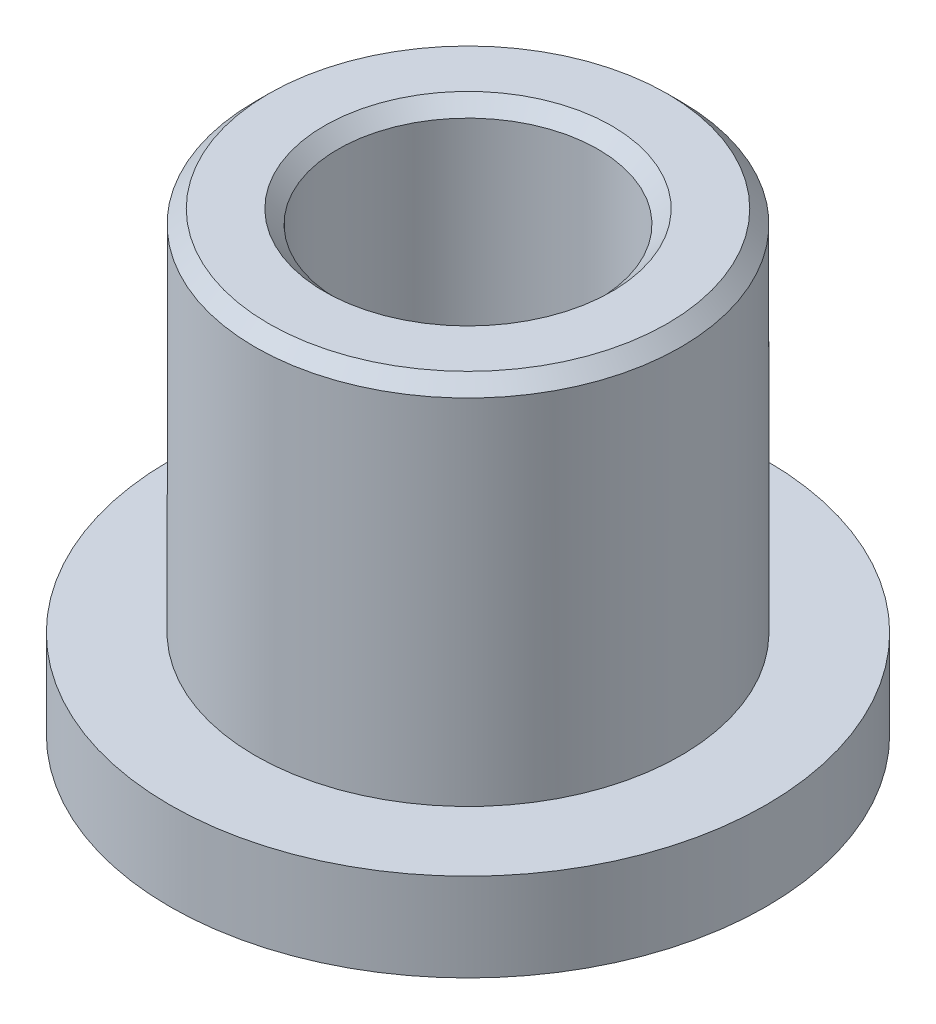
ISO-10303-21;
HEADER;
FILE_DESCRIPTION(('STEP AP214'),'2;1');
FILE_NAME('part.step','',(''),(''),'','','');
FILE_SCHEMA(('AUTOMOTIVE_DESIGN { 1 0 10303 214 1 1 1 1 }'));
ENDSEC;
DATA;
#1=APPLICATION_CONTEXT('core data for automotive mechanical design processes');
#2=APPLICATION_PROTOCOL_DEFINITION('international standard','automotive_design',2000,#1);
#3=PRODUCT_CONTEXT('',#1,'mechanical');
#4=PRODUCT('Part','Part','',(#3));
#5=PRODUCT_RELATED_PRODUCT_CATEGORY('part','',(#4));
#6=PRODUCT_DEFINITION_FORMATION('','',#4);
#7=PRODUCT_DEFINITION_CONTEXT('part definition',#1,'design');
#8=PRODUCT_DEFINITION('design','',#6,#7);
#9=PRODUCT_DEFINITION_SHAPE('','',#8);
#10=(LENGTH_UNIT() NAMED_UNIT(*) SI_UNIT(.MILLI.,.METRE.));
#11=(NAMED_UNIT(*) PLANE_ANGLE_UNIT() SI_UNIT($,.RADIAN.));
#12=(NAMED_UNIT(*) SI_UNIT($,.STERADIAN.) SOLID_ANGLE_UNIT());
#13=UNCERTAINTY_MEASURE_WITH_UNIT(LENGTH_MEASURE(1.E-05),#10,'distance_accuracy_value','');
#14=(GEOMETRIC_REPRESENTATION_CONTEXT(3) GLOBAL_UNCERTAINTY_ASSIGNED_CONTEXT((#13)) GLOBAL_UNIT_ASSIGNED_CONTEXT((#10,
#11,#12)) REPRESENTATION_CONTEXT('',''));
#15=CARTESIAN_POINT('',(0.,0.,0.));
#16=DIRECTION('',(0.,0.,1.));
#17=DIRECTION('',(1.,0.,0.));
#18=AXIS2_PLACEMENT_3D('',#15,#16,#17);
#19=CARTESIAN_POINT('',(5.5,1.62560000005684,0.));
#20=DIRECTION('',(0.,-1.,0.));
#21=DIRECTION('',(0.,0.,-1.));
#22=AXIS2_PLACEMENT_3D('',#19,#20,#21);
#23=PLANE('',#22);
#24=CARTESIAN_POINT('',(0.,1.62560000005684,0.));
#25=DIRECTION('',(0.,1.,0.));
#26=DIRECTION('',(0.,0.,1.));
#27=AXIS2_PLACEMENT_3D('',#24,#25,#26);
#28=CIRCLE('',#27,3.92500000001473);
#29=CARTESIAN_POINT('',(0.,1.62560000005684,3.92500000001473));
#30=VERTEX_POINT('',#29);
#31=EDGE_CURVE('E63',#30,#30,#28,.T.);
#32=ORIENTED_EDGE('',*,*,#31,.F.);
#33=EDGE_LOOP('',(#32));
#34=FACE_BOUND('',#33,.T.);
#35=CARTESIAN_POINT('',(0.,1.62560000005684,0.));
#36=DIRECTION('',(0.,1.,0.));
#37=DIRECTION('',(0.,0.,1.));
#38=AXIS2_PLACEMENT_3D('',#35,#36,#37);
#39=CIRCLE('',#38,5.5);
#40=CARTESIAN_POINT('',(0.,1.62560000005684,5.5));
#41=VERTEX_POINT('',#40);
#42=EDGE_CURVE('E51',#41,#41,#39,.T.);
#43=ORIENTED_EDGE('',*,*,#42,.T.);
#44=EDGE_LOOP('',(#43));
#45=FACE_BOUND('',#44,.T.);
#46=ADVANCED_FACE('F31',(#34,#45),#23,.F.);
#47=CARTESIAN_POINT('',(0.,0.,0.));
#48=DIRECTION('',(0.,1.,0.));
#49=DIRECTION('',(0.,0.,1.));
#50=AXIS2_PLACEMENT_3D('',#47,#48,#49);
#51=CYLINDRICAL_SURFACE('',#50,5.5);
#52=ORIENTED_EDGE('',*,*,#42,.F.);
#53=EDGE_LOOP('',(#52));
#54=FACE_BOUND('',#53,.T.);
#55=CARTESIAN_POINT('',(0.,5.68434763593111E-11,0.));
#56=DIRECTION('',(0.,1.,0.));
#57=DIRECTION('',(0.,0.,1.));
#58=AXIS2_PLACEMENT_3D('',#55,#56,#57);
#59=CIRCLE('',#58,5.5);
#60=CARTESIAN_POINT('',(0.,5.68434763593111E-11,5.5));
#61=VERTEX_POINT('',#60);
#62=EDGE_CURVE('E54',#61,#61,#59,.T.);
#63=ORIENTED_EDGE('',*,*,#62,.T.);
#64=EDGE_LOOP('',(#63));
#65=FACE_BOUND('',#64,.T.);
#66=ADVANCED_FACE('F71',(#54,#65),#51,.T.);
#67=CARTESIAN_POINT('',(5.5,5.68434476100596E-11,0.));
#68=DIRECTION('',(0.,1.,0.));
#69=DIRECTION('',(0.,0.,1.));
#70=AXIS2_PLACEMENT_3D('',#67,#68,#69);
#71=PLANE('',#70);
#72=ORIENTED_EDGE('',*,*,#62,.F.);
#73=EDGE_LOOP('',(#72));
#74=FACE_BOUND('',#73,.T.);
#75=CARTESIAN_POINT('',(0.,5.6843418860808E-11,0.));
#76=DIRECTION('',(0.,1.,0.));
#77=DIRECTION('',(0.,0.,1.));
#78=AXIS2_PLACEMENT_3D('',#75,#76,#77);
#79=CIRCLE('',#78,2.59999999997262);
#80=CARTESIAN_POINT('',(0.,5.6843418860808E-11,2.59999999997262));
#81=VERTEX_POINT('',#80);
#82=EDGE_CURVE('E57',#81,#81,#79,.T.);
#83=ORIENTED_EDGE('',*,*,#82,.T.);
#84=EDGE_LOOP('',(#83));
#85=FACE_BOUND('',#84,.T.);
#86=ADVANCED_FACE('F77',(#74,#85),#71,.F.);
#87=CARTESIAN_POINT('',(0.,0.200000000014732,0.));
#88=DIRECTION('',(0.,-1.,0.));
#89=DIRECTION('',(0.,0.,-1.));
#90=AXIS2_PLACEMENT_3D('',#87,#88,#89);
#91=CONICAL_SURFACE('',#90,2.40000000001473,0.785398163397448);
#92=ORIENTED_EDGE('',*,*,#82,.F.);
#93=EDGE_LOOP('',(#92));
#94=FACE_BOUND('',#93,.T.);
#95=CARTESIAN_POINT('',(0.,0.200000000014732,0.));
#96=DIRECTION('',(0.,1.,0.));
#97=DIRECTION('',(0.,0.,1.));
#98=AXIS2_PLACEMENT_3D('',#95,#96,#97);
#99=CIRCLE('',#98,2.40000000001473);
#100=CARTESIAN_POINT('',(0.,0.200000000014732,2.40000000001473));
#101=VERTEX_POINT('',#100);
#102=EDGE_CURVE('E60',#101,#101,#99,.T.);
#103=ORIENTED_EDGE('',*,*,#102,.T.);
#104=EDGE_LOOP('',(#103));
#105=FACE_BOUND('',#104,.T.);
#106=ADVANCED_FACE('F83',(#94,#105),#91,.F.);
#107=CARTESIAN_POINT('',(0.,0.,0.));
#108=DIRECTION('',(0.,1.,0.));
#109=DIRECTION('',(0.,0.,1.));
#110=AXIS2_PLACEMENT_3D('',#107,#108,#109);
#111=CYLINDRICAL_SURFACE('',#110,2.40000000001473);
#112=CARTESIAN_POINT('',(0.,8.15000000001474,0.));
#113=DIRECTION('',(0.,-1.,0.));
#114=DIRECTION('',(0.,0.,-1.));
#115=AXIS2_PLACEMENT_3D('',#112,#113,#114);
#116=CIRCLE('',#115,2.40000000001473);
#117=CARTESIAN_POINT('',(0.,8.15000000001474,-2.40000000001473));
#118=VERTEX_POINT('',#117);
#119=EDGE_CURVE('E46',#118,#118,#116,.F.);
#120=ORIENTED_EDGE('',*,*,#119,.T.);
#121=EDGE_LOOP('',(#120));
#122=FACE_BOUND('',#121,.T.);
#123=ORIENTED_EDGE('',*,*,#102,.F.);
#124=EDGE_LOOP('',(#123));
#125=FACE_BOUND('',#124,.T.);
#126=ADVANCED_FACE('F89',(#122,#125),#111,.F.);
#127=CARTESIAN_POINT('',(0.,0.,0.));
#128=DIRECTION('',(0.,1.,0.));
#129=DIRECTION('',(0.,0.,1.));
#130=AXIS2_PLACEMENT_3D('',#127,#128,#129);
#131=CYLINDRICAL_SURFACE('',#130,3.92500000001473);
#132=CARTESIAN_POINT('',(0.,8.15000000001473,0.));
#133=DIRECTION('',(0.,-1.,0.));
#134=DIRECTION('',(0.,0.,-1.));
#135=AXIS2_PLACEMENT_3D('',#132,#133,#134);
#136=CIRCLE('',#135,3.92500000001473);
#137=CARTESIAN_POINT('',(0.,8.15000000001473,-3.92500000001473));
#138=VERTEX_POINT('',#137);
#139=EDGE_CURVE('E10',#138,#138,#136,.T.);
#140=ORIENTED_EDGE('',*,*,#139,.T.);
#141=EDGE_LOOP('',(#140));
#142=FACE_BOUND('',#141,.T.);
#143=ORIENTED_EDGE('',*,*,#31,.T.);
#144=EDGE_LOOP('',(#143));
#145=FACE_BOUND('',#144,.T.);
#146=ADVANCED_FACE('F67',(#142,#145),#131,.T.);
#147=CARTESIAN_POINT('',(-7.,8.40000000001473,-5.5));
#148=DIRECTION('',(0.,-1.,0.));
#149=DIRECTION('',(0.,0.,-1.));
#150=AXIS2_PLACEMENT_3D('',#147,#148,#149);
#151=PLANE('',#150);
#152=CARTESIAN_POINT('',(0.,8.40000000001473,0.));
#153=DIRECTION('',(0.,-1.,0.));
#154=DIRECTION('',(0.,0.,-1.));
#155=AXIS2_PLACEMENT_3D('',#152,#153,#154);
#156=CIRCLE('',#155,2.65000000001473);
#157=CARTESIAN_POINT('',(0.,8.40000000001473,-2.65000000001473));
#158=VERTEX_POINT('',#157);
#159=EDGE_CURVE('E38',#158,#158,#156,.T.);
#160=ORIENTED_EDGE('',*,*,#159,.T.);
#161=EDGE_LOOP('',(#160));
#162=FACE_BOUND('',#161,.T.);
#163=CARTESIAN_POINT('',(0.,8.40000000001473,0.));
#164=DIRECTION('',(0.,-1.,0.));
#165=DIRECTION('',(0.,0.,-1.));
#166=AXIS2_PLACEMENT_3D('',#163,#164,#165);
#167=CIRCLE('',#166,3.67500000001473);
#168=CARTESIAN_POINT('',(0.,8.40000000001473,-3.67500000001473));
#169=VERTEX_POINT('',#168);
#170=EDGE_CURVE('E42',#169,#169,#167,.F.);
#171=ORIENTED_EDGE('',*,*,#170,.T.);
#172=EDGE_LOOP('',(#171));
#173=FACE_BOUND('',#172,.T.);
#174=ADVANCED_FACE('F99',(#162,#173),#151,.F.);
#175=CARTESIAN_POINT('',(0.,8.15000000001474,0.));
#176=DIRECTION('',(0.,1.,0.));
#177=DIRECTION('',(0.,0.,1.));
#178=AXIS2_PLACEMENT_3D('',#175,#176,#177);
#179=CONICAL_SURFACE('',#178,2.40000000001473,0.785398163397453);
#180=ORIENTED_EDGE('',*,*,#159,.F.);
#181=EDGE_LOOP('',(#180));
#182=FACE_BOUND('',#181,.T.);
#183=ORIENTED_EDGE('',*,*,#119,.F.);
#184=EDGE_LOOP('',(#183));
#185=FACE_BOUND('',#184,.T.);
#186=ADVANCED_FACE('F102',(#182,#185),#179,.F.);
#187=CARTESIAN_POINT('',(0.,8.15000000001473,0.));
#188=DIRECTION('',(0.,-1.,0.));
#189=DIRECTION('',(0.,0.,-1.));
#190=AXIS2_PLACEMENT_3D('',#187,#188,#189);
#191=CONICAL_SURFACE('',#190,3.92500000001473,0.785398163397454);
#192=ORIENTED_EDGE('',*,*,#170,.F.);
#193=EDGE_LOOP('',(#192));
#194=FACE_BOUND('',#193,.T.);
#195=ORIENTED_EDGE('',*,*,#139,.F.);
#196=EDGE_LOOP('',(#195));
#197=FACE_BOUND('',#196,.T.);
#198=ADVANCED_FACE('F33',(#194,#197),#191,.T.);
#199=CLOSED_SHELL('',(#46,#66,#86,#106,#126,#146,#174,#186,#198));
#200=MANIFOLD_SOLID_BREP('B2',#199);
#201=ADVANCED_BREP_SHAPE_REPRESENTATION('',(#18,#200),#14);
#202=SHAPE_DEFINITION_REPRESENTATION(#9,#201);
ENDSEC;
END-ISO-10303-21;
